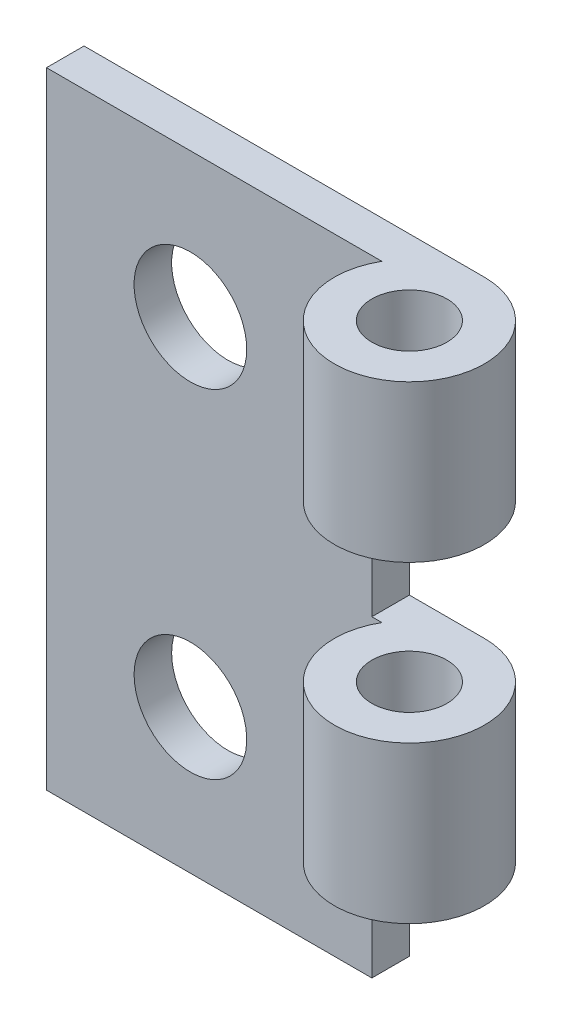
ISO-10303-21;
HEADER;
FILE_DESCRIPTION(('STEP AP214'),'2;1');
FILE_NAME('part.step','',(''),(''),'','','');
FILE_SCHEMA(('AUTOMOTIVE_DESIGN { 1 0 10303 214 1 1 1 1 }'));
ENDSEC;
DATA;
#1=APPLICATION_CONTEXT('core data for automotive mechanical design processes');
#2=APPLICATION_PROTOCOL_DEFINITION('international standard','automotive_design',2000,#1);
#3=PRODUCT_CONTEXT('',#1,'mechanical');
#4=PRODUCT('Part','Part','',(#3));
#5=PRODUCT_RELATED_PRODUCT_CATEGORY('part','',(#4));
#6=PRODUCT_DEFINITION_FORMATION('','',#4);
#7=PRODUCT_DEFINITION_CONTEXT('part definition',#1,'design');
#8=PRODUCT_DEFINITION('design','',#6,#7);
#9=PRODUCT_DEFINITION_SHAPE('','',#8);
#10=(LENGTH_UNIT() NAMED_UNIT(*) SI_UNIT(.MILLI.,.METRE.));
#11=(NAMED_UNIT(*) PLANE_ANGLE_UNIT() SI_UNIT($,.RADIAN.));
#12=(NAMED_UNIT(*) SI_UNIT($,.STERADIAN.) SOLID_ANGLE_UNIT());
#13=UNCERTAINTY_MEASURE_WITH_UNIT(LENGTH_MEASURE(1.E-05),#10,'distance_accuracy_value','');
#14=(GEOMETRIC_REPRESENTATION_CONTEXT(3) GLOBAL_UNCERTAINTY_ASSIGNED_CONTEXT((#13)) GLOBAL_UNIT_ASSIGNED_CONTEXT((#10,
#11,#12)) REPRESENTATION_CONTEXT('',''));
#15=CARTESIAN_POINT('',(0.,0.,0.));
#16=DIRECTION('',(0.,0.,1.));
#17=DIRECTION('',(1.,0.,0.));
#18=AXIS2_PLACEMENT_3D('',#15,#16,#17);
#19=CARTESIAN_POINT('',(9.49999999999999,12.5,3.));
#20=DIRECTION('',(0.,-1.,0.));
#21=DIRECTION('',(0.,0.,-1.));
#22=AXIS2_PLACEMENT_3D('',#19,#20,#21);
#23=CYLINDRICAL_SURFACE('',#22,3.);
#24=CARTESIAN_POINT('',(9.49999999999999,6.25,3.));
#25=DIRECTION('',(0.,1.,0.));
#26=DIRECTION('',(0.,0.,1.));
#27=AXIS2_PLACEMENT_3D('',#24,#25,#26);
#28=CIRCLE('',#27,3.);
#29=CARTESIAN_POINT('',(9.49999999999999,6.25,0.));
#30=VERTEX_POINT('',#29);
#31=CARTESIAN_POINT('',(6.90192378864668,6.25,1.5));
#32=VERTEX_POINT('',#31);
#33=EDGE_CURVE('E113',#30,#32,#28,.F.);
#34=ORIENTED_EDGE('',*,*,#33,.F.);
#35=DIRECTION('',(0.,-1.,0.));
#36=VECTOR('',#35,1.);
#37=CARTESIAN_POINT('',(9.49999999999999,12.5,0.));
#38=LINE('',#37,#36);
#39=CARTESIAN_POINT('',(9.49999999999999,12.5,0.));
#40=VERTEX_POINT('',#39);
#41=EDGE_CURVE('E152',#40,#30,#38,.T.);
#42=ORIENTED_EDGE('',*,*,#41,.F.);
#43=CARTESIAN_POINT('',(9.49999999999999,12.5,3.));
#44=DIRECTION('',(0.,-1.,0.));
#45=DIRECTION('',(0.,0.,-1.));
#46=AXIS2_PLACEMENT_3D('',#43,#44,#45);
#47=CIRCLE('',#46,3.);
#48=CARTESIAN_POINT('',(6.90192378864668,12.5,1.5));
#49=VERTEX_POINT('',#48);
#50=EDGE_CURVE('E80',#40,#49,#47,.T.);
#51=ORIENTED_EDGE('',*,*,#50,.T.);
#52=DIRECTION('',(0.,-1.,0.));
#53=VECTOR('',#52,1.);
#54=CARTESIAN_POINT('',(6.90192378864668,12.5,1.5));
#55=LINE('',#54,#53);
#56=EDGE_CURVE('E55',#49,#32,#55,.T.);
#57=ORIENTED_EDGE('',*,*,#56,.T.);
#58=EDGE_LOOP('',(#34,#42,#51,#57));
#59=FACE_BOUND('',#58,.T.);
#60=ADVANCED_FACE('F38',(#59),#23,.T.);
#61=CARTESIAN_POINT('',(0.,0.,1.5));
#62=DIRECTION('',(0.,0.,1.));
#63=DIRECTION('',(1.,0.,0.));
#64=AXIS2_PLACEMENT_3D('',#61,#62,#63);
#65=PLANE('',#64);
#66=DIRECTION('',(1.,0.,0.));
#67=VECTOR('',#66,1.);
#68=CARTESIAN_POINT('',(0.,0.,1.5));
#69=LINE('',#68,#67);
#70=CARTESIAN_POINT('',(6.49999999999999,0.,1.5));
#71=VERTEX_POINT('',#70);
#72=CARTESIAN_POINT('',(6.90192378864668,0.,1.5));
#73=VERTEX_POINT('',#72);
#74=EDGE_CURVE('E136',#71,#73,#69,.T.);
#75=ORIENTED_EDGE('',*,*,#74,.F.);
#76=DIRECTION('',(0.,-1.,0.));
#77=VECTOR('',#76,1.);
#78=CARTESIAN_POINT('',(6.49999999999999,0.,1.5));
#79=LINE('',#78,#77);
#80=CARTESIAN_POINT('',(6.49999999999999,6.25,1.5));
#81=VERTEX_POINT('',#80);
#82=EDGE_CURVE('E142',#81,#71,#79,.T.);
#83=ORIENTED_EDGE('',*,*,#82,.F.);
#84=DIRECTION('',(-1.,0.,0.));
#85=VECTOR('',#84,1.);
#86=CARTESIAN_POINT('',(0.,6.25,1.5));
#87=LINE('',#86,#85);
#88=EDGE_CURVE('E118',#32,#81,#87,.T.);
#89=ORIENTED_EDGE('',*,*,#88,.F.);
#90=ORIENTED_EDGE('',*,*,#56,.F.);
#91=DIRECTION('',(-1.,0.,0.));
#92=VECTOR('',#91,1.);
#93=CARTESIAN_POINT('',(6.5,12.5,1.5));
#94=LINE('',#93,#92);
#95=CARTESIAN_POINT('',(-6.5,12.5,1.5));
#96=VERTEX_POINT('',#95);
#97=EDGE_CURVE('E60',#49,#96,#94,.T.);
#98=ORIENTED_EDGE('',*,*,#97,.T.);
#99=DIRECTION('',(0.,-1.,0.));
#100=VECTOR('',#99,1.);
#101=CARTESIAN_POINT('',(-6.5,-12.5,1.5));
#102=LINE('',#101,#100);
#103=CARTESIAN_POINT('',(-6.5,-12.5,1.5));
#104=VERTEX_POINT('',#103);
#105=EDGE_CURVE('E85',#96,#104,#102,.T.);
#106=ORIENTED_EDGE('',*,*,#105,.T.);
#107=DIRECTION('',(1.,0.,0.));
#108=VECTOR('',#107,1.);
#109=CARTESIAN_POINT('',(6.5,-12.5,1.5));
#110=LINE('',#109,#108);
#111=CARTESIAN_POINT('',(6.49999999999999,-12.5,1.5));
#112=VERTEX_POINT('',#111);
#113=EDGE_CURVE('E162',#104,#112,#110,.T.);
#114=ORIENTED_EDGE('',*,*,#113,.T.);
#115=DIRECTION('',(0.,-1.,0.));
#116=VECTOR('',#115,1.);
#117=CARTESIAN_POINT('',(6.49999999999999,0.,1.5));
#118=LINE('',#117,#116);
#119=CARTESIAN_POINT('',(6.49999999999999,-6.25,1.5));
#120=VERTEX_POINT('',#119);
#121=EDGE_CURVE('E139',#120,#112,#118,.T.);
#122=ORIENTED_EDGE('',*,*,#121,.F.);
#123=DIRECTION('',(-1.,0.,0.));
#124=VECTOR('',#123,1.);
#125=CARTESIAN_POINT('',(0.,-6.25,1.5));
#126=LINE('',#125,#124);
#127=CARTESIAN_POINT('',(6.90192378864668,-6.25,1.5));
#128=VERTEX_POINT('',#127);
#129=EDGE_CURVE('E114',#128,#120,#126,.T.);
#130=ORIENTED_EDGE('',*,*,#129,.F.);
#131=EDGE_CURVE('E149',#73,#128,#55,.T.);
#132=ORIENTED_EDGE('',*,*,#131,.F.);
#133=EDGE_LOOP('',(#75,#83,#89,#90,#98,#106,#114,#122,#130,#132));
#134=FACE_BOUND('',#133,.T.);
#135=CARTESIAN_POINT('',(-0.749999999999997,6.75,1.5));
#136=DIRECTION('',(0.,0.,1.));
#137=DIRECTION('',(1.,0.,0.));
#138=AXIS2_PLACEMENT_3D('',#135,#136,#137);
#139=CIRCLE('',#138,2.25);
#140=CARTESIAN_POINT('',(1.5,6.75,1.5));
#141=VERTEX_POINT('',#140);
#142=EDGE_CURVE('E98',#141,#141,#139,.T.);
#143=ORIENTED_EDGE('',*,*,#142,.F.);
#144=EDGE_LOOP('',(#143));
#145=FACE_BOUND('',#144,.T.);
#146=CARTESIAN_POINT('',(-0.749999999999997,-6.74999999999999,1.5));
#147=DIRECTION('',(0.,0.,1.));
#148=DIRECTION('',(-1.,0.,0.));
#149=AXIS2_PLACEMENT_3D('',#146,#147,#148);
#150=CIRCLE('',#149,2.25);
#151=CARTESIAN_POINT('',(-3.,-6.74999999999999,1.5));
#152=VERTEX_POINT('',#151);
#153=EDGE_CURVE('E155',#152,#152,#150,.T.);
#154=ORIENTED_EDGE('',*,*,#153,.F.);
#155=EDGE_LOOP('',(#154));
#156=FACE_BOUND('',#155,.T.);
#157=ADVANCED_FACE('F167',(#134,#145,#156),#65,.T.);
#158=CARTESIAN_POINT('',(0.,0.,0.));
#159=DIRECTION('',(0.,0.,1.));
#160=DIRECTION('',(1.,0.,0.));
#161=AXIS2_PLACEMENT_3D('',#158,#159,#160);
#162=PLANE('',#161);
#163=DIRECTION('',(0.,1.,0.));
#164=VECTOR('',#163,1.);
#165=CARTESIAN_POINT('',(6.49999999999999,6.25,0.));
#166=LINE('',#165,#164);
#167=CARTESIAN_POINT('',(6.49999999999999,0.,0.));
#168=VERTEX_POINT('',#167);
#169=CARTESIAN_POINT('',(6.49999999999999,6.25,0.));
#170=VERTEX_POINT('',#169);
#171=EDGE_CURVE('E194',#168,#170,#166,.T.);
#172=ORIENTED_EDGE('',*,*,#171,.F.);
#173=DIRECTION('',(-1.,0.,0.));
#174=VECTOR('',#173,1.);
#175=CARTESIAN_POINT('',(6.49999999999999,0.,0.));
#176=LINE('',#175,#174);
#177=CARTESIAN_POINT('',(9.49999999999999,0.,0.));
#178=VERTEX_POINT('',#177);
#179=EDGE_CURVE('E190',#178,#168,#176,.T.);
#180=ORIENTED_EDGE('',*,*,#179,.F.);
#181=CARTESIAN_POINT('',(9.49999999999999,-6.25,0.));
#182=VERTEX_POINT('',#181);
#183=EDGE_CURVE('E151',#178,#182,#38,.T.);
#184=ORIENTED_EDGE('',*,*,#183,.T.);
#185=DIRECTION('',(1.,0.,0.));
#186=VECTOR('',#185,1.);
#187=CARTESIAN_POINT('',(12.5,-6.25,0.));
#188=LINE('',#187,#186);
#189=CARTESIAN_POINT('',(6.49999999999999,-6.25,0.));
#190=VERTEX_POINT('',#189);
#191=EDGE_CURVE('E180',#190,#182,#188,.T.);
#192=ORIENTED_EDGE('',*,*,#191,.F.);
#193=DIRECTION('',(0.,1.,0.));
#194=VECTOR('',#193,1.);
#195=CARTESIAN_POINT('',(6.49999999999999,-6.25,0.));
#196=LINE('',#195,#194);
#197=CARTESIAN_POINT('',(6.49999999999999,-12.5,0.));
#198=VERTEX_POINT('',#197);
#199=EDGE_CURVE('E184',#198,#190,#196,.T.);
#200=ORIENTED_EDGE('',*,*,#199,.F.);
#201=DIRECTION('',(1.,0.,0.));
#202=VECTOR('',#201,1.);
#203=CARTESIAN_POINT('',(6.5,-12.5,0.));
#204=LINE('',#203,#202);
#205=CARTESIAN_POINT('',(-6.5,-12.5,0.));
#206=VERTEX_POINT('',#205);
#207=EDGE_CURVE('E86',#206,#198,#204,.T.);
#208=ORIENTED_EDGE('',*,*,#207,.F.);
#209=DIRECTION('',(0.,-1.,0.));
#210=VECTOR('',#209,1.);
#211=CARTESIAN_POINT('',(-6.5,-12.5,0.));
#212=LINE('',#211,#210);
#213=CARTESIAN_POINT('',(-6.5,12.5,0.));
#214=VERTEX_POINT('',#213);
#215=EDGE_CURVE('E91',#214,#206,#212,.T.);
#216=ORIENTED_EDGE('',*,*,#215,.F.);
#217=DIRECTION('',(-1.,0.,0.));
#218=VECTOR('',#217,1.);
#219=CARTESIAN_POINT('',(6.5,12.5,0.));
#220=LINE('',#219,#218);
#221=EDGE_CURVE('E74',#40,#214,#220,.T.);
#222=ORIENTED_EDGE('',*,*,#221,.F.);
#223=ORIENTED_EDGE('',*,*,#41,.T.);
#224=DIRECTION('',(1.,0.,0.));
#225=VECTOR('',#224,1.);
#226=CARTESIAN_POINT('',(12.5,6.25,0.));
#227=LINE('',#226,#225);
#228=EDGE_CURVE('E201',#170,#30,#227,.T.);
#229=ORIENTED_EDGE('',*,*,#228,.F.);
#230=EDGE_LOOP('',(#172,#180,#184,#192,#200,#208,#216,#222,#223,#229));
#231=FACE_BOUND('',#230,.T.);
#232=CARTESIAN_POINT('',(-0.749999999999997,6.75,0.));
#233=DIRECTION('',(0.,0.,1.));
#234=DIRECTION('',(1.,0.,0.));
#235=AXIS2_PLACEMENT_3D('',#232,#233,#234);
#236=CIRCLE('',#235,2.25);
#237=CARTESIAN_POINT('',(1.5,6.75,0.));
#238=VERTEX_POINT('',#237);
#239=EDGE_CURVE('E102',#238,#238,#236,.T.);
#240=ORIENTED_EDGE('',*,*,#239,.T.);
#241=EDGE_LOOP('',(#240));
#242=FACE_BOUND('',#241,.T.);
#243=CARTESIAN_POINT('',(-0.749999999999997,-6.74999999999999,0.));
#244=DIRECTION('',(0.,0.,1.));
#245=DIRECTION('',(-1.,0.,0.));
#246=AXIS2_PLACEMENT_3D('',#243,#244,#245);
#247=CIRCLE('',#246,2.25);
#248=CARTESIAN_POINT('',(-3.,-6.74999999999999,0.));
#249=VERTEX_POINT('',#248);
#250=EDGE_CURVE('E154',#249,#249,#247,.T.);
#251=ORIENTED_EDGE('',*,*,#250,.T.);
#252=EDGE_LOOP('',(#251));
#253=FACE_BOUND('',#252,.T.);
#254=ADVANCED_FACE('F94',(#231,#242,#253),#162,.F.);
#255=CARTESIAN_POINT('',(-6.5,-12.5,1.5));
#256=DIRECTION('',(1.,0.,0.));
#257=DIRECTION('',(0.,0.,-1.));
#258=AXIS2_PLACEMENT_3D('',#255,#256,#257);
#259=PLANE('',#258);
#260=ORIENTED_EDGE('',*,*,#215,.T.);
#261=DIRECTION('',(0.,0.,-1.));
#262=VECTOR('',#261,1.);
#263=CARTESIAN_POINT('',(-6.5,-12.5,1.5));
#264=LINE('',#263,#262);
#265=EDGE_CURVE('E11',#104,#206,#264,.T.);
#266=ORIENTED_EDGE('',*,*,#265,.F.);
#267=ORIENTED_EDGE('',*,*,#105,.F.);
#268=DIRECTION('',(0.,0.,-1.));
#269=VECTOR('',#268,1.);
#270=CARTESIAN_POINT('',(-6.5,12.5,1.5));
#271=LINE('',#270,#269);
#272=EDGE_CURVE('E47',#96,#214,#271,.T.);
#273=ORIENTED_EDGE('',*,*,#272,.T.);
#274=EDGE_LOOP('',(#260,#266,#267,#273));
#275=FACE_BOUND('',#274,.T.);
#276=ADVANCED_FACE('F40',(#275),#259,.F.);
#277=CARTESIAN_POINT('',(6.5,-12.5,1.5));
#278=DIRECTION('',(0.,1.,0.));
#279=DIRECTION('',(0.,0.,1.));
#280=AXIS2_PLACEMENT_3D('',#277,#278,#279);
#281=PLANE('',#280);
#282=ORIENTED_EDGE('',*,*,#207,.T.);
#283=DIRECTION('',(0.,0.,-1.));
#284=VECTOR('',#283,1.);
#285=CARTESIAN_POINT('',(6.49999999999999,-12.5,6.));
#286=LINE('',#285,#284);
#287=EDGE_CURVE('E176',#112,#198,#286,.T.);
#288=ORIENTED_EDGE('',*,*,#287,.F.);
#289=ORIENTED_EDGE('',*,*,#113,.F.);
#290=ORIENTED_EDGE('',*,*,#265,.T.);
#291=EDGE_LOOP('',(#282,#288,#289,#290));
#292=FACE_BOUND('',#291,.T.);
#293=ADVANCED_FACE('F174',(#292),#281,.F.);
#294=CARTESIAN_POINT('',(6.5,12.5,1.5));
#295=DIRECTION('',(0.,-1.,0.));
#296=DIRECTION('',(0.,0.,-1.));
#297=AXIS2_PLACEMENT_3D('',#294,#295,#296);
#298=PLANE('',#297);
#299=ORIENTED_EDGE('',*,*,#97,.F.);
#300=ORIENTED_EDGE('',*,*,#50,.F.);
#301=ORIENTED_EDGE('',*,*,#221,.T.);
#302=ORIENTED_EDGE('',*,*,#272,.F.);
#303=EDGE_LOOP('',(#299,#300,#301,#302));
#304=FACE_BOUND('',#303,.T.);
#305=CARTESIAN_POINT('',(9.49999999999999,12.5,3.));
#306=DIRECTION('',(0.,-1.,0.));
#307=DIRECTION('',(0.,0.,-1.));
#308=AXIS2_PLACEMENT_3D('',#305,#306,#307);
#309=CIRCLE('',#308,1.5);
#310=CARTESIAN_POINT('',(9.49999999999999,12.5,1.5));
#311=VERTEX_POINT('',#310);
#312=EDGE_CURVE('E145',#311,#311,#309,.T.);
#313=ORIENTED_EDGE('',*,*,#312,.T.);
#314=EDGE_LOOP('',(#313));
#315=FACE_BOUND('',#314,.T.);
#316=ADVANCED_FACE('F76',(#304,#315),#298,.F.);
#317=CARTESIAN_POINT('',(-0.749999999999997,6.75,1.5));
#318=DIRECTION('',(0.,0.,-1.));
#319=DIRECTION('',(-1.,0.,0.));
#320=AXIS2_PLACEMENT_3D('',#317,#318,#319);
#321=CYLINDRICAL_SURFACE('',#320,2.25);
#322=ORIENTED_EDGE('',*,*,#142,.T.);
#323=EDGE_LOOP('',(#322));
#324=FACE_BOUND('',#323,.T.);
#325=ORIENTED_EDGE('',*,*,#239,.F.);
#326=EDGE_LOOP('',(#325));
#327=FACE_BOUND('',#326,.T.);
#328=ADVANCED_FACE('F262',(#324,#327),#321,.F.);
#329=CARTESIAN_POINT('',(-0.749999999999997,-6.74999999999999,1.5));
#330=DIRECTION('',(0.,0.,-1.));
#331=DIRECTION('',(-1.,0.,0.));
#332=AXIS2_PLACEMENT_3D('',#329,#330,#331);
#333=CYLINDRICAL_SURFACE('',#332,2.25);
#334=ORIENTED_EDGE('',*,*,#153,.T.);
#335=EDGE_LOOP('',(#334));
#336=FACE_BOUND('',#335,.T.);
#337=ORIENTED_EDGE('',*,*,#250,.F.);
#338=EDGE_LOOP('',(#337));
#339=FACE_BOUND('',#338,.T.);
#340=ADVANCED_FACE('F255',(#336,#339),#333,.F.);
#341=CARTESIAN_POINT('',(9.49999999999999,0.,3.));
#342=DIRECTION('',(0.,-1.,0.));
#343=DIRECTION('',(0.,0.,-1.));
#344=AXIS2_PLACEMENT_3D('',#341,#342,#343);
#345=CIRCLE('',#344,3.);
#346=EDGE_CURVE('E133',#73,#178,#345,.F.);
#347=ORIENTED_EDGE('',*,*,#346,.F.);
#348=ORIENTED_EDGE('',*,*,#131,.T.);
#349=CARTESIAN_POINT('',(9.49999999999999,-6.25,3.));
#350=DIRECTION('',(0.,1.,0.));
#351=DIRECTION('',(0.,0.,1.));
#352=AXIS2_PLACEMENT_3D('',#349,#350,#351);
#353=CIRCLE('',#352,3.);
#354=EDGE_CURVE('E109',#182,#128,#353,.F.);
#355=ORIENTED_EDGE('',*,*,#354,.F.);
#356=ORIENTED_EDGE('',*,*,#183,.F.);
#357=EDGE_LOOP('',(#347,#348,#355,#356));
#358=FACE_BOUND('',#357,.T.);
#359=ADVANCED_FACE('F228',(#358),#23,.T.);
#360=CARTESIAN_POINT('',(9.49999999999999,12.5,3.));
#361=DIRECTION('',(0.,-1.,0.));
#362=DIRECTION('',(0.,0.,-1.));
#363=AXIS2_PLACEMENT_3D('',#360,#361,#362);
#364=CYLINDRICAL_SURFACE('',#363,1.5);
#365=CARTESIAN_POINT('',(9.49999999999999,6.25,3.));
#366=DIRECTION('',(0.,1.,0.));
#367=DIRECTION('',(0.,0.,1.));
#368=AXIS2_PLACEMENT_3D('',#365,#366,#367);
#369=CIRCLE('',#368,1.5);
#370=CARTESIAN_POINT('',(9.49999999999999,6.25,4.5));
#371=VERTEX_POINT('',#370);
#372=EDGE_CURVE('E111',#371,#371,#369,.F.);
#373=ORIENTED_EDGE('',*,*,#372,.T.);
#374=EDGE_LOOP('',(#373));
#375=FACE_BOUND('',#374,.T.);
#376=ORIENTED_EDGE('',*,*,#312,.F.);
#377=EDGE_LOOP('',(#376));
#378=FACE_BOUND('',#377,.T.);
#379=ADVANCED_FACE('F254',(#375,#378),#364,.F.);
#380=CARTESIAN_POINT('',(6.49999999999999,-6.25,6.));
#381=DIRECTION('',(-1.,0.,0.));
#382=DIRECTION('',(0.,0.,1.));
#383=AXIS2_PLACEMENT_3D('',#380,#381,#382);
#384=PLANE('',#383);
#385=ORIENTED_EDGE('',*,*,#121,.T.);
#386=ORIENTED_EDGE('',*,*,#287,.T.);
#387=ORIENTED_EDGE('',*,*,#199,.T.);
#388=DIRECTION('',(0.,0.,-1.));
#389=VECTOR('',#388,1.);
#390=CARTESIAN_POINT('',(6.49999999999999,-6.25,6.));
#391=LINE('',#390,#389);
#392=EDGE_CURVE('E181',#120,#190,#391,.T.);
#393=ORIENTED_EDGE('',*,*,#392,.F.);
#394=EDGE_LOOP('',(#385,#386,#387,#393));
#395=FACE_BOUND('',#394,.T.);
#396=ADVANCED_FACE('F260',(#395),#384,.F.);
#397=CARTESIAN_POINT('',(12.5,-6.25,6.));
#398=DIRECTION('',(0.,1.,0.));
#399=DIRECTION('',(0.,0.,1.));
#400=AXIS2_PLACEMENT_3D('',#397,#398,#399);
#401=PLANE('',#400);
#402=ORIENTED_EDGE('',*,*,#129,.T.);
#403=ORIENTED_EDGE('',*,*,#392,.T.);
#404=ORIENTED_EDGE('',*,*,#191,.T.);
#405=ORIENTED_EDGE('',*,*,#354,.T.);
#406=EDGE_LOOP('',(#402,#403,#404,#405));
#407=FACE_BOUND('',#406,.T.);
#408=CARTESIAN_POINT('',(9.49999999999999,-6.25,3.));
#409=DIRECTION('',(0.,1.,0.));
#410=DIRECTION('',(0.,0.,1.));
#411=AXIS2_PLACEMENT_3D('',#408,#409,#410);
#412=CIRCLE('',#411,1.5);
#413=CARTESIAN_POINT('',(9.49999999999999,-6.25,4.5));
#414=VERTEX_POINT('',#413);
#415=EDGE_CURVE('E107',#414,#414,#412,.F.);
#416=ORIENTED_EDGE('',*,*,#415,.F.);
#417=EDGE_LOOP('',(#416));
#418=FACE_BOUND('',#417,.T.);
#419=ADVANCED_FACE('F369',(#407,#418),#401,.F.);
#420=CARTESIAN_POINT('',(6.49999999999999,6.25,6.));
#421=DIRECTION('',(-1.,0.,0.));
#422=DIRECTION('',(0.,-1.,0.));
#423=AXIS2_PLACEMENT_3D('',#420,#421,#422);
#424=PLANE('',#423);
#425=ORIENTED_EDGE('',*,*,#82,.T.);
#426=DIRECTION('',(0.,0.,-1.));
#427=VECTOR('',#426,1.);
#428=CARTESIAN_POINT('',(6.49999999999999,0.,6.));
#429=LINE('',#428,#427);
#430=EDGE_CURVE('E188',#71,#168,#429,.T.);
#431=ORIENTED_EDGE('',*,*,#430,.T.);
#432=ORIENTED_EDGE('',*,*,#171,.T.);
#433=DIRECTION('',(0.,0.,-1.));
#434=VECTOR('',#433,1.);
#435=CARTESIAN_POINT('',(6.49999999999999,6.25,6.));
#436=LINE('',#435,#434);
#437=EDGE_CURVE('E110',#81,#170,#436,.T.);
#438=ORIENTED_EDGE('',*,*,#437,.F.);
#439=EDGE_LOOP('',(#425,#431,#432,#438));
#440=FACE_BOUND('',#439,.T.);
#441=ADVANCED_FACE('F210',(#440),#424,.F.);
#442=CARTESIAN_POINT('',(6.49999999999999,0.,6.));
#443=DIRECTION('',(0.,-1.,0.));
#444=DIRECTION('',(0.,0.,-1.));
#445=AXIS2_PLACEMENT_3D('',#442,#443,#444);
#446=PLANE('',#445);
#447=ORIENTED_EDGE('',*,*,#74,.T.);
#448=ORIENTED_EDGE('',*,*,#346,.T.);
#449=ORIENTED_EDGE('',*,*,#179,.T.);
#450=ORIENTED_EDGE('',*,*,#430,.F.);
#451=EDGE_LOOP('',(#447,#448,#449,#450));
#452=FACE_BOUND('',#451,.T.);
#453=CARTESIAN_POINT('',(9.49999999999999,0.,3.));
#454=DIRECTION('',(0.,-1.,0.));
#455=DIRECTION('',(0.,0.,-1.));
#456=AXIS2_PLACEMENT_3D('',#453,#454,#455);
#457=CIRCLE('',#456,1.5);
#458=CARTESIAN_POINT('',(9.49999999999999,0.,1.5));
#459=VERTEX_POINT('',#458);
#460=EDGE_CURVE('E42',#459,#459,#457,.F.);
#461=ORIENTED_EDGE('',*,*,#460,.F.);
#462=EDGE_LOOP('',(#461));
#463=FACE_BOUND('',#462,.T.);
#464=ADVANCED_FACE('F215',(#452,#463),#446,.F.);
#465=CARTESIAN_POINT('',(12.5,6.25,6.));
#466=DIRECTION('',(0.,1.,0.));
#467=DIRECTION('',(0.,0.,1.));
#468=AXIS2_PLACEMENT_3D('',#465,#466,#467);
#469=PLANE('',#468);
#470=ORIENTED_EDGE('',*,*,#88,.T.);
#471=ORIENTED_EDGE('',*,*,#437,.T.);
#472=ORIENTED_EDGE('',*,*,#228,.T.);
#473=ORIENTED_EDGE('',*,*,#33,.T.);
#474=EDGE_LOOP('',(#470,#471,#472,#473));
#475=FACE_BOUND('',#474,.T.);
#476=ORIENTED_EDGE('',*,*,#372,.F.);
#477=EDGE_LOOP('',(#476));
#478=FACE_BOUND('',#477,.T.);
#479=ADVANCED_FACE('F242',(#475,#478),#469,.F.);
#480=ORIENTED_EDGE('',*,*,#460,.T.);
#481=EDGE_LOOP('',(#480));
#482=FACE_BOUND('',#481,.T.);
#483=ORIENTED_EDGE('',*,*,#415,.T.);
#484=EDGE_LOOP('',(#483));
#485=FACE_BOUND('',#484,.T.);
#486=ADVANCED_FACE('F261',(#482,#485),#364,.F.);
#487=CLOSED_SHELL('',(#60,#157,#254,#276,#293,#316,#328,#340,#359,#379,#396,#419,#441,#464,#479,#486));
#488=MANIFOLD_SOLID_BREP('B2',#487);
#489=ADVANCED_BREP_SHAPE_REPRESENTATION('',(#18,#488),#14);
#490=SHAPE_DEFINITION_REPRESENTATION(#9,#489);
ENDSEC;
END-ISO-10303-21;
